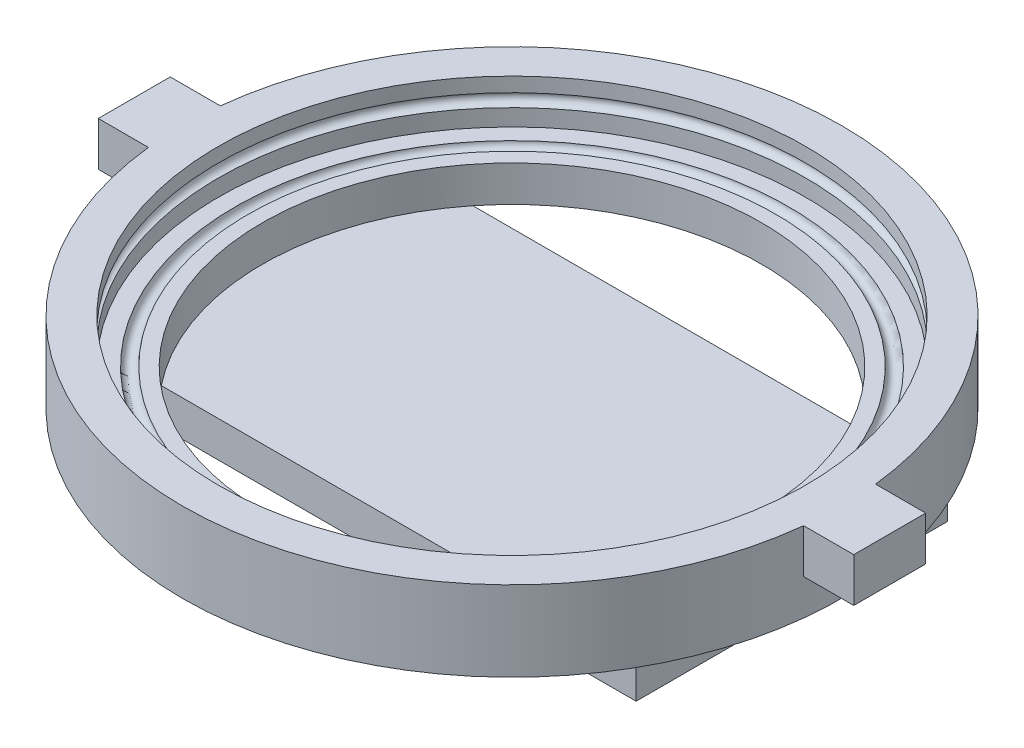
ISO-10303-21;
HEADER;
FILE_DESCRIPTION(('STEP AP214'),'2;1');
FILE_NAME('part.step','',(''),(''),'','','');
FILE_SCHEMA(('AUTOMOTIVE_DESIGN { 1 0 10303 214 1 1 1 1 }'));
ENDSEC;
DATA;
#1=APPLICATION_CONTEXT('core data for automotive mechanical design processes');
#2=APPLICATION_PROTOCOL_DEFINITION('international standard','automotive_design',2000,#1);
#3=PRODUCT_CONTEXT('',#1,'mechanical');
#4=PRODUCT('Part','Part','',(#3));
#5=PRODUCT_RELATED_PRODUCT_CATEGORY('part','',(#4));
#6=PRODUCT_DEFINITION_FORMATION('','',#4);
#7=PRODUCT_DEFINITION_CONTEXT('part definition',#1,'design');
#8=PRODUCT_DEFINITION('design','',#6,#7);
#9=PRODUCT_DEFINITION_SHAPE('','',#8);
#10=(LENGTH_UNIT() NAMED_UNIT(*) SI_UNIT(.MILLI.,.METRE.));
#11=(NAMED_UNIT(*) PLANE_ANGLE_UNIT() SI_UNIT($,.RADIAN.));
#12=(NAMED_UNIT(*) SI_UNIT($,.STERADIAN.) SOLID_ANGLE_UNIT());
#13=UNCERTAINTY_MEASURE_WITH_UNIT(LENGTH_MEASURE(1.E-05),#10,'distance_accuracy_value','');
#14=(GEOMETRIC_REPRESENTATION_CONTEXT(3) GLOBAL_UNCERTAINTY_ASSIGNED_CONTEXT((#13)) GLOBAL_UNIT_ASSIGNED_CONTEXT((#10,
#11,#12)) REPRESENTATION_CONTEXT('',''));
#15=CARTESIAN_POINT('',(0.,0.,0.));
#16=DIRECTION('',(0.,0.,1.));
#17=DIRECTION('',(1.,0.,0.));
#18=AXIS2_PLACEMENT_3D('',#15,#16,#17);
#19=CARTESIAN_POINT('',(116.3447,-38.9255,0.));
#20=DIRECTION('',(0.,1.,0.));
#21=DIRECTION('',(0.,0.,1.));
#22=AXIS2_PLACEMENT_3D('',#19,#20,#21);
#23=PLANE('',#22);
#24=CARTESIAN_POINT('',(0.,-38.9255,0.));
#25=DIRECTION('',(0.,1.,0.));
#26=DIRECTION('',(0.,0.,1.));
#27=AXIS2_PLACEMENT_3D('',#24,#25,#26);
#28=CIRCLE('',#27,116.3447);
#29=CARTESIAN_POINT('',(0.,-38.9255,116.3447));
#30=VERTEX_POINT('',#29);
#31=EDGE_CURVE('E286',#30,#30,#28,.T.);
#32=ORIENTED_EDGE('',*,*,#31,.F.);
#33=EDGE_LOOP('',(#32));
#34=FACE_BOUND('',#33,.T.);
#35=DIRECTION('',(-1.,0.,0.));
#36=VECTOR('',#35,1.);
#37=CARTESIAN_POINT('',(-98.806,-38.9255,54.991));
#38=LINE('',#37,#36);
#39=CARTESIAN_POINT('',(-68.8138410702382,-38.9255,54.991));
#40=VERTEX_POINT('',#39);
#41=CARTESIAN_POINT('',(-98.806,-38.9255,54.991));
#42=VERTEX_POINT('',#41);
#43=EDGE_CURVE('E237',#40,#42,#38,.T.);
#44=ORIENTED_EDGE('',*,*,#43,.F.);
#45=CARTESIAN_POINT('',(0.,-38.9255,0.));
#46=DIRECTION('',(0.,1.,0.));
#47=DIRECTION('',(0.,0.,1.));
#48=AXIS2_PLACEMENT_3D('',#45,#46,#47);
#49=CIRCLE('',#48,88.0872);
#50=CARTESIAN_POINT('',(68.8138410702382,-38.9255,54.991));
#51=VERTEX_POINT('',#50);
#52=EDGE_CURVE('E281',#40,#51,#49,.T.);
#53=ORIENTED_EDGE('',*,*,#52,.T.);
#54=CARTESIAN_POINT('',(98.806,-38.9255,54.991));
#55=VERTEX_POINT('',#54);
#56=EDGE_CURVE('E210',#55,#51,#38,.T.);
#57=ORIENTED_EDGE('',*,*,#56,.F.);
#58=DIRECTION('',(0.,0.,1.));
#59=VECTOR('',#58,1.);
#60=CARTESIAN_POINT('',(98.806,-38.9255,54.991));
#61=LINE('',#60,#59);
#62=CARTESIAN_POINT('',(98.806,-38.9255,-54.991));
#63=VERTEX_POINT('',#62);
#64=EDGE_CURVE('E228',#63,#55,#61,.T.);
#65=ORIENTED_EDGE('',*,*,#64,.F.);
#66=DIRECTION('',(1.,0.,0.));
#67=VECTOR('',#66,1.);
#68=CARTESIAN_POINT('',(-98.806,-38.9255,-54.991));
#69=LINE('',#68,#67);
#70=CARTESIAN_POINT('',(68.8138410702382,-38.9255,-54.991));
#71=VERTEX_POINT('',#70);
#72=EDGE_CURVE('E229',#71,#63,#69,.T.);
#73=ORIENTED_EDGE('',*,*,#72,.F.);
#74=CARTESIAN_POINT('',(-68.8138410702382,-38.9255,-54.991));
#75=VERTEX_POINT('',#74);
#76=EDGE_CURVE('E287',#71,#75,#49,.T.);
#77=ORIENTED_EDGE('',*,*,#76,.T.);
#78=CARTESIAN_POINT('',(-98.806,-38.9255,-54.991));
#79=VERTEX_POINT('',#78);
#80=EDGE_CURVE('E224',#79,#75,#69,.T.);
#81=ORIENTED_EDGE('',*,*,#80,.F.);
#82=DIRECTION('',(0.,0.,-1.));
#83=VECTOR('',#82,1.);
#84=CARTESIAN_POINT('',(-98.806,-38.9255,54.991));
#85=LINE('',#84,#83);
#86=EDGE_CURVE('E191',#42,#79,#85,.T.);
#87=ORIENTED_EDGE('',*,*,#86,.F.);
#88=EDGE_LOOP('',(#44,#53,#57,#65,#73,#77,#81,#87));
#89=FACE_BOUND('',#88,.T.);
#90=ADVANCED_FACE('F39',(#34,#89),#23,.F.);
#91=CARTESIAN_POINT('',(103.6447,-10.668,0.));
#92=DIRECTION('',(0.,-1.,0.));
#93=DIRECTION('',(0.,0.,-1.));
#94=AXIS2_PLACEMENT_3D('',#91,#92,#93);
#95=PLANE('',#94);
#96=DIRECTION('',(1.,0.,0.));
#97=VECTOR('',#96,1.);
#98=CARTESIAN_POINT('',(-133.35,-10.668,12.7));
#99=LINE('',#98,#97);
#100=CARTESIAN_POINT('',(-133.35,-10.668,12.7));
#101=VERTEX_POINT('',#100);
#102=CARTESIAN_POINT('',(-115.649467003052,-10.668,12.7));
#103=VERTEX_POINT('',#102);
#104=EDGE_CURVE('E157',#101,#103,#99,.T.);
#105=ORIENTED_EDGE('',*,*,#104,.T.);
#106=CARTESIAN_POINT('',(0.,-10.668,0.));
#107=DIRECTION('',(0.,1.,0.));
#108=DIRECTION('',(0.,0.,1.));
#109=AXIS2_PLACEMENT_3D('',#106,#107,#108);
#110=CIRCLE('',#109,116.3447);
#111=CARTESIAN_POINT('',(115.649467003052,-10.668,12.7));
#112=VERTEX_POINT('',#111);
#113=EDGE_CURVE('E291',#103,#112,#110,.T.);
#114=ORIENTED_EDGE('',*,*,#113,.T.);
#115=DIRECTION('',(1.,0.,0.));
#116=VECTOR('',#115,1.);
#117=CARTESIAN_POINT('',(133.35,-10.668,12.7));
#118=LINE('',#117,#116);
#119=CARTESIAN_POINT('',(133.35,-10.668,12.7));
#120=VERTEX_POINT('',#119);
#121=EDGE_CURVE('E183',#112,#120,#118,.T.);
#122=ORIENTED_EDGE('',*,*,#121,.T.);
#123=DIRECTION('',(0.,0.,-1.));
#124=VECTOR('',#123,1.);
#125=CARTESIAN_POINT('',(133.35,-10.668,-12.7));
#126=LINE('',#125,#124);
#127=CARTESIAN_POINT('',(133.35,-10.668,-12.7));
#128=VERTEX_POINT('',#127);
#129=EDGE_CURVE('E178',#120,#128,#126,.T.);
#130=ORIENTED_EDGE('',*,*,#129,.T.);
#131=DIRECTION('',(-1.,0.,0.));
#132=VECTOR('',#131,1.);
#133=CARTESIAN_POINT('',(133.35,-10.668,-12.7));
#134=LINE('',#133,#132);
#135=CARTESIAN_POINT('',(115.649467003052,-10.668,-12.7));
#136=VERTEX_POINT('',#135);
#137=EDGE_CURVE('E177',#128,#136,#134,.T.);
#138=ORIENTED_EDGE('',*,*,#137,.T.);
#139=CARTESIAN_POINT('',(-115.649467003052,-10.668,-12.7));
#140=VERTEX_POINT('',#139);
#141=EDGE_CURVE('E292',#136,#140,#110,.T.);
#142=ORIENTED_EDGE('',*,*,#141,.T.);
#143=DIRECTION('',(-1.,0.,0.));
#144=VECTOR('',#143,1.);
#145=CARTESIAN_POINT('',(-133.35,-10.668,-12.7));
#146=LINE('',#145,#144);
#147=CARTESIAN_POINT('',(-133.35,-10.668,-12.7));
#148=VERTEX_POINT('',#147);
#149=EDGE_CURVE('E55',#140,#148,#146,.T.);
#150=ORIENTED_EDGE('',*,*,#149,.T.);
#151=DIRECTION('',(0.,0.,1.));
#152=VECTOR('',#151,1.);
#153=CARTESIAN_POINT('',(-133.35,-10.668,-12.7));
#154=LINE('',#153,#152);
#155=EDGE_CURVE('E168',#148,#101,#154,.T.);
#156=ORIENTED_EDGE('',*,*,#155,.T.);
#157=EDGE_LOOP('',(#105,#114,#122,#130,#138,#142,#150,#156));
#158=FACE_BOUND('',#157,.T.);
#159=CARTESIAN_POINT('',(0.,-10.668,0.));
#160=DIRECTION('',(0.,1.,0.));
#161=DIRECTION('',(0.,0.,1.));
#162=AXIS2_PLACEMENT_3D('',#159,#160,#161);
#163=CIRCLE('',#162,103.6447);
#164=CARTESIAN_POINT('',(0.,-10.668,103.6447));
#165=VERTEX_POINT('',#164);
#166=EDGE_CURVE('E253',#165,#165,#163,.T.);
#167=ORIENTED_EDGE('',*,*,#166,.F.);
#168=EDGE_LOOP('',(#167));
#169=FACE_BOUND('',#168,.T.);
#170=ADVANCED_FACE('F41',(#158,#169),#95,.F.);
#171=CARTESIAN_POINT('',(0.,0.,0.));
#172=DIRECTION('',(0.,1.,0.));
#173=DIRECTION('',(0.,0.,1.));
#174=AXIS2_PLACEMENT_3D('',#171,#172,#173);
#175=CYLINDRICAL_SURFACE('',#174,116.3447);
#176=ORIENTED_EDGE('',*,*,#113,.F.);
#177=DIRECTION('',(0.,1.,0.));
#178=VECTOR('',#177,1.);
#179=CARTESIAN_POINT('',(-115.649467003052,0.,12.7));
#180=LINE('',#179,#178);
#181=CARTESIAN_POINT('',(-115.649467003052,-26.2255,12.7));
#182=VERTEX_POINT('',#181);
#183=EDGE_CURVE('E11',#103,#182,#180,.F.);
#184=ORIENTED_EDGE('',*,*,#183,.T.);
#185=CARTESIAN_POINT('',(0.,-26.2255,0.));
#186=DIRECTION('',(0.,-1.,0.));
#187=DIRECTION('',(0.,0.,-1.));
#188=AXIS2_PLACEMENT_3D('',#185,#186,#187);
#189=CIRCLE('',#188,116.3447);
#190=CARTESIAN_POINT('',(-115.649467003052,-26.2255,-12.7));
#191=VERTEX_POINT('',#190);
#192=EDGE_CURVE('E48',#182,#191,#189,.T.);
#193=ORIENTED_EDGE('',*,*,#192,.T.);
#194=DIRECTION('',(0.,1.,0.));
#195=VECTOR('',#194,1.);
#196=CARTESIAN_POINT('',(-115.649467003052,0.,-12.7));
#197=LINE('',#196,#195);
#198=EDGE_CURVE('E308',#191,#140,#197,.T.);
#199=ORIENTED_EDGE('',*,*,#198,.T.);
#200=ORIENTED_EDGE('',*,*,#141,.F.);
#201=DIRECTION('',(0.,1.,0.));
#202=VECTOR('',#201,1.);
#203=CARTESIAN_POINT('',(115.649467003052,0.,-12.7));
#204=LINE('',#203,#202);
#205=CARTESIAN_POINT('',(115.649467003052,-26.2255,-12.7));
#206=VERTEX_POINT('',#205);
#207=EDGE_CURVE('E296',#136,#206,#204,.F.);
#208=ORIENTED_EDGE('',*,*,#207,.T.);
#209=CARTESIAN_POINT('',(0.,-26.2255,0.));
#210=DIRECTION('',(0.,-1.,0.));
#211=DIRECTION('',(0.,0.,-1.));
#212=AXIS2_PLACEMENT_3D('',#209,#210,#211);
#213=CIRCLE('',#212,116.3447);
#214=CARTESIAN_POINT('',(115.649467003052,-26.2255,12.7));
#215=VERTEX_POINT('',#214);
#216=EDGE_CURVE('E300',#206,#215,#213,.T.);
#217=ORIENTED_EDGE('',*,*,#216,.T.);
#218=DIRECTION('',(0.,1.,0.));
#219=VECTOR('',#218,1.);
#220=CARTESIAN_POINT('',(115.649467003052,0.,12.7));
#221=LINE('',#220,#219);
#222=EDGE_CURVE('E304',#215,#112,#221,.T.);
#223=ORIENTED_EDGE('',*,*,#222,.T.);
#224=EDGE_LOOP('',(#176,#184,#193,#199,#200,#208,#217,#223));
#225=FACE_BOUND('',#224,.T.);
#226=ORIENTED_EDGE('',*,*,#31,.T.);
#227=EDGE_LOOP('',(#226));
#228=FACE_BOUND('',#227,.T.);
#229=ADVANCED_FACE('F313',(#225,#228),#175,.T.);
#230=CARTESIAN_POINT('',(0.,0.,0.));
#231=DIRECTION('',(0.,1.,0.));
#232=DIRECTION('',(0.,0.,1.));
#233=AXIS2_PLACEMENT_3D('',#230,#231,#232);
#234=CYLINDRICAL_SURFACE('',#233,88.0872);
#235=EDGE_CURVE('E282',#51,#71,#49,.T.);
#236=ORIENTED_EDGE('',*,*,#235,.F.);
#237=ORIENTED_EDGE('',*,*,#52,.F.);
#238=EDGE_CURVE('E595',#75,#40,#49,.T.);
#239=ORIENTED_EDGE('',*,*,#238,.F.);
#240=ORIENTED_EDGE('',*,*,#76,.F.);
#241=EDGE_LOOP('',(#236,#237,#239,#240));
#242=FACE_BOUND('',#241,.T.);
#243=CARTESIAN_POINT('',(0.,-26.2255,0.));
#244=DIRECTION('',(0.,1.,0.));
#245=DIRECTION('',(0.,0.,1.));
#246=AXIS2_PLACEMENT_3D('',#243,#244,#245);
#247=CIRCLE('',#246,88.0872);
#248=CARTESIAN_POINT('',(0.,-26.2255,88.0872));
#249=VERTEX_POINT('',#248);
#250=EDGE_CURVE('E277',#249,#249,#247,.T.);
#251=ORIENTED_EDGE('',*,*,#250,.T.);
#252=EDGE_LOOP('',(#251));
#253=FACE_BOUND('',#252,.T.);
#254=ADVANCED_FACE('F340',(#242,#253),#234,.F.);
#255=CARTESIAN_POINT('',(93.1672,-26.2255,0.));
#256=DIRECTION('',(0.,-1.,0.));
#257=DIRECTION('',(0.,0.,-1.));
#258=AXIS2_PLACEMENT_3D('',#255,#256,#257);
#259=PLANE('',#258);
#260=ORIENTED_EDGE('',*,*,#250,.F.);
#261=EDGE_LOOP('',(#260));
#262=FACE_BOUND('',#261,.T.);
#263=CARTESIAN_POINT('',(0.,-26.2255,0.));
#264=DIRECTION('',(0.,1.,0.));
#265=DIRECTION('',(0.,0.,1.));
#266=AXIS2_PLACEMENT_3D('',#263,#264,#265);
#267=CIRCLE('',#266,93.1672);
#268=CARTESIAN_POINT('',(0.,-26.2255,93.1672));
#269=VERTEX_POINT('',#268);
#270=EDGE_CURVE('E273',#269,#269,#267,.T.);
#271=ORIENTED_EDGE('',*,*,#270,.T.);
#272=EDGE_LOOP('',(#271));
#273=FACE_BOUND('',#272,.T.);
#274=ADVANCED_FACE('F346',(#262,#273),#259,.F.);
#275=CARTESIAN_POINT('',(0.,-26.2255,0.));
#276=DIRECTION('',(0.,1.,0.));
#277=DIRECTION('',(0.,0.,1.));
#278=AXIS2_PLACEMENT_3D('',#275,#276,#277);
#279=TOROIDAL_SURFACE('',#278,95.4532,2.28600000000001);
#280=ORIENTED_EDGE('',*,*,#270,.F.);
#281=EDGE_LOOP('',(#280));
#282=FACE_BOUND('',#281,.T.);
#283=CARTESIAN_POINT('',(0.,-26.2255,0.));
#284=DIRECTION('',(0.,1.,0.));
#285=DIRECTION('',(0.,0.,1.));
#286=AXIS2_PLACEMENT_3D('',#283,#284,#285);
#287=CIRCLE('',#286,97.7392);
#288=CARTESIAN_POINT('',(0.,-26.2255,97.7392));
#289=VERTEX_POINT('',#288);
#290=EDGE_CURVE('E269',#289,#289,#287,.T.);
#291=ORIENTED_EDGE('',*,*,#290,.T.);
#292=EDGE_LOOP('',(#291));
#293=FACE_BOUND('',#292,.T.);
#294=ADVANCED_FACE('F351',(#282,#293),#279,.F.);
#295=CARTESIAN_POINT('',(103.6447,-26.2255,0.));
#296=DIRECTION('',(0.,-1.,0.));
#297=DIRECTION('',(0.,0.,-1.));
#298=AXIS2_PLACEMENT_3D('',#295,#296,#297);
#299=PLANE('',#298);
#300=ORIENTED_EDGE('',*,*,#290,.F.);
#301=EDGE_LOOP('',(#300));
#302=FACE_BOUND('',#301,.T.);
#303=CARTESIAN_POINT('',(0.,-26.2255,0.));
#304=DIRECTION('',(0.,1.,0.));
#305=DIRECTION('',(0.,0.,1.));
#306=AXIS2_PLACEMENT_3D('',#303,#304,#305);
#307=CIRCLE('',#306,103.6447);
#308=CARTESIAN_POINT('',(0.,-26.2255,103.6447));
#309=VERTEX_POINT('',#308);
#310=EDGE_CURVE('E265',#309,#309,#307,.T.);
#311=ORIENTED_EDGE('',*,*,#310,.T.);
#312=EDGE_LOOP('',(#311));
#313=FACE_BOUND('',#312,.T.);
#314=ADVANCED_FACE('F364',(#302,#313),#299,.F.);
#315=CARTESIAN_POINT('',(0.,0.,0.));
#316=DIRECTION('',(0.,1.,0.));
#317=DIRECTION('',(0.,0.,1.));
#318=AXIS2_PLACEMENT_3D('',#315,#316,#317);
#319=CYLINDRICAL_SURFACE('',#318,103.6447);
#320=ORIENTED_EDGE('',*,*,#310,.F.);
#321=EDGE_LOOP('',(#320));
#322=FACE_BOUND('',#321,.T.);
#323=CARTESIAN_POINT('',(0.,-20.32,0.));
#324=DIRECTION('',(0.,1.,0.));
#325=DIRECTION('',(0.,0.,1.));
#326=AXIS2_PLACEMENT_3D('',#323,#324,#325);
#327=CIRCLE('',#326,103.6447);
#328=CARTESIAN_POINT('',(0.,-20.32,103.6447));
#329=VERTEX_POINT('',#328);
#330=EDGE_CURVE('E261',#329,#329,#327,.T.);
#331=ORIENTED_EDGE('',*,*,#330,.T.);
#332=EDGE_LOOP('',(#331));
#333=FACE_BOUND('',#332,.T.);
#334=ADVANCED_FACE('F370',(#322,#333),#319,.F.);
#335=CARTESIAN_POINT('',(0.,-18.034,0.));
#336=DIRECTION('',(0.,1.,0.));
#337=DIRECTION('',(0.,0.,1.));
#338=AXIS2_PLACEMENT_3D('',#335,#336,#337);
#339=TOROIDAL_SURFACE('',#338,103.6447,2.286);
#340=ORIENTED_EDGE('',*,*,#330,.F.);
#341=EDGE_LOOP('',(#340));
#342=FACE_BOUND('',#341,.T.);
#343=CARTESIAN_POINT('',(0.,-15.748,0.));
#344=DIRECTION('',(0.,1.,0.));
#345=DIRECTION('',(0.,0.,1.));
#346=AXIS2_PLACEMENT_3D('',#343,#344,#345);
#347=CIRCLE('',#346,103.6447);
#348=CARTESIAN_POINT('',(0.,-15.748,103.6447));
#349=VERTEX_POINT('',#348);
#350=EDGE_CURVE('E257',#349,#349,#347,.T.);
#351=ORIENTED_EDGE('',*,*,#350,.T.);
#352=EDGE_LOOP('',(#351));
#353=FACE_BOUND('',#352,.T.);
#354=ADVANCED_FACE('F376',(#342,#353),#339,.F.);
#355=CARTESIAN_POINT('',(0.,0.,0.));
#356=DIRECTION('',(0.,1.,0.));
#357=DIRECTION('',(0.,0.,1.));
#358=AXIS2_PLACEMENT_3D('',#355,#356,#357);
#359=CYLINDRICAL_SURFACE('',#358,103.6447);
#360=ORIENTED_EDGE('',*,*,#350,.F.);
#361=EDGE_LOOP('',(#360));
#362=FACE_BOUND('',#361,.T.);
#363=ORIENTED_EDGE('',*,*,#166,.T.);
#364=EDGE_LOOP('',(#363));
#365=FACE_BOUND('',#364,.T.);
#366=ADVANCED_FACE('F382',(#362,#365),#359,.F.);
#367=CARTESIAN_POINT('',(0.,-38.9255,0.));
#368=DIRECTION('',(0.,-1.,0.));
#369=DIRECTION('',(0.,0.,-1.));
#370=AXIS2_PLACEMENT_3D('',#367,#368,#369);
#371=PLANE('',#370);
#372=EDGE_CURVE('E233',#51,#40,#38,.T.);
#373=ORIENTED_EDGE('',*,*,#372,.F.);
#374=ORIENTED_EDGE('',*,*,#235,.T.);
#375=EDGE_CURVE('E223',#75,#71,#69,.T.);
#376=ORIENTED_EDGE('',*,*,#375,.F.);
#377=ORIENTED_EDGE('',*,*,#238,.T.);
#378=EDGE_LOOP('',(#373,#374,#376,#377));
#379=FACE_BOUND('',#378,.T.);
#380=ADVANCED_FACE('F388',(#379),#371,.F.);
#381=CARTESIAN_POINT('',(-98.806,-51.6255,54.991));
#382=DIRECTION('',(1.,0.,0.));
#383=DIRECTION('',(0.,0.,-1.));
#384=AXIS2_PLACEMENT_3D('',#381,#382,#383);
#385=PLANE('',#384);
#386=ORIENTED_EDGE('',*,*,#86,.T.);
#387=DIRECTION('',(0.,1.,0.));
#388=VECTOR('',#387,1.);
#389=CARTESIAN_POINT('',(-98.806,-51.6255,-54.991));
#390=LINE('',#389,#388);
#391=CARTESIAN_POINT('',(-98.806,-51.6255,-54.991));
#392=VERTEX_POINT('',#391);
#393=EDGE_CURVE('E249',#392,#79,#390,.T.);
#394=ORIENTED_EDGE('',*,*,#393,.F.);
#395=DIRECTION('',(0.,0.,-1.));
#396=VECTOR('',#395,1.);
#397=CARTESIAN_POINT('',(-98.806,-51.6255,54.991));
#398=LINE('',#397,#396);
#399=CARTESIAN_POINT('',(-98.806,-51.6255,54.991));
#400=VERTEX_POINT('',#399);
#401=EDGE_CURVE('E205',#400,#392,#398,.T.);
#402=ORIENTED_EDGE('',*,*,#401,.F.);
#403=DIRECTION('',(0.,1.,0.));
#404=VECTOR('',#403,1.);
#405=CARTESIAN_POINT('',(-98.806,-51.6255,54.991));
#406=LINE('',#405,#404);
#407=EDGE_CURVE('E219',#400,#42,#406,.T.);
#408=ORIENTED_EDGE('',*,*,#407,.T.);
#409=EDGE_LOOP('',(#386,#394,#402,#408));
#410=FACE_BOUND('',#409,.T.);
#411=ADVANCED_FACE('F394',(#410),#385,.F.);
#412=CARTESIAN_POINT('',(-98.806,-51.6255,-54.991));
#413=DIRECTION('',(0.,0.,1.));
#414=DIRECTION('',(1.,0.,0.));
#415=AXIS2_PLACEMENT_3D('',#412,#413,#414);
#416=PLANE('',#415);
#417=ORIENTED_EDGE('',*,*,#80,.T.);
#418=ORIENTED_EDGE('',*,*,#375,.T.);
#419=ORIENTED_EDGE('',*,*,#72,.T.);
#420=DIRECTION('',(0.,1.,0.));
#421=VECTOR('',#420,1.);
#422=CARTESIAN_POINT('',(98.806,-51.6255,-54.991));
#423=LINE('',#422,#421);
#424=CARTESIAN_POINT('',(98.806,-51.6255,-54.991));
#425=VERTEX_POINT('',#424);
#426=EDGE_CURVE('E245',#425,#63,#423,.T.);
#427=ORIENTED_EDGE('',*,*,#426,.F.);
#428=DIRECTION('',(1.,0.,0.));
#429=VECTOR('',#428,1.);
#430=CARTESIAN_POINT('',(-98.806,-51.6255,-54.991));
#431=LINE('',#430,#429);
#432=EDGE_CURVE('E209',#392,#425,#431,.T.);
#433=ORIENTED_EDGE('',*,*,#432,.F.);
#434=ORIENTED_EDGE('',*,*,#393,.T.);
#435=EDGE_LOOP('',(#417,#418,#419,#427,#433,#434));
#436=FACE_BOUND('',#435,.T.);
#437=ADVANCED_FACE('F400',(#436),#416,.F.);
#438=CARTESIAN_POINT('',(98.806,-51.6255,54.991));
#439=DIRECTION('',(-1.,0.,0.));
#440=DIRECTION('',(0.,0.,1.));
#441=AXIS2_PLACEMENT_3D('',#438,#439,#440);
#442=PLANE('',#441);
#443=ORIENTED_EDGE('',*,*,#64,.T.);
#444=DIRECTION('',(0.,1.,0.));
#445=VECTOR('',#444,1.);
#446=CARTESIAN_POINT('',(98.806,-51.6255,54.991));
#447=LINE('',#446,#445);
#448=CARTESIAN_POINT('',(98.806,-51.6255,54.991));
#449=VERTEX_POINT('',#448);
#450=EDGE_CURVE('E241',#449,#55,#447,.T.);
#451=ORIENTED_EDGE('',*,*,#450,.F.);
#452=DIRECTION('',(0.,0.,1.));
#453=VECTOR('',#452,1.);
#454=CARTESIAN_POINT('',(98.806,-51.6255,54.991));
#455=LINE('',#454,#453);
#456=EDGE_CURVE('E213',#425,#449,#455,.T.);
#457=ORIENTED_EDGE('',*,*,#456,.F.);
#458=ORIENTED_EDGE('',*,*,#426,.T.);
#459=EDGE_LOOP('',(#443,#451,#457,#458));
#460=FACE_BOUND('',#459,.T.);
#461=ADVANCED_FACE('F404',(#460),#442,.F.);
#462=CARTESIAN_POINT('',(-98.806,-51.6255,54.991));
#463=DIRECTION('',(0.,0.,-1.));
#464=DIRECTION('',(-1.,0.,0.));
#465=AXIS2_PLACEMENT_3D('',#462,#463,#464);
#466=PLANE('',#465);
#467=ORIENTED_EDGE('',*,*,#56,.T.);
#468=ORIENTED_EDGE('',*,*,#372,.T.);
#469=ORIENTED_EDGE('',*,*,#43,.T.);
#470=ORIENTED_EDGE('',*,*,#407,.F.);
#471=DIRECTION('',(-1.,0.,0.));
#472=VECTOR('',#471,1.);
#473=CARTESIAN_POINT('',(-98.806,-51.6255,54.991));
#474=LINE('',#473,#472);
#475=EDGE_CURVE('E216',#449,#400,#474,.T.);
#476=ORIENTED_EDGE('',*,*,#475,.F.);
#477=ORIENTED_EDGE('',*,*,#450,.T.);
#478=EDGE_LOOP('',(#467,#468,#469,#470,#476,#477));
#479=FACE_BOUND('',#478,.T.);
#480=ADVANCED_FACE('F408',(#479),#466,.F.);
#481=CARTESIAN_POINT('',(0.,-51.6255,0.));
#482=DIRECTION('',(0.,-1.,0.));
#483=DIRECTION('',(0.,0.,-1.));
#484=AXIS2_PLACEMENT_3D('',#481,#482,#483);
#485=PLANE('',#484);
#486=ORIENTED_EDGE('',*,*,#401,.T.);
#487=ORIENTED_EDGE('',*,*,#432,.T.);
#488=ORIENTED_EDGE('',*,*,#456,.T.);
#489=ORIENTED_EDGE('',*,*,#475,.T.);
#490=EDGE_LOOP('',(#486,#487,#488,#489));
#491=FACE_BOUND('',#490,.T.);
#492=ADVANCED_FACE('F411',(#491),#485,.T.);
#493=CARTESIAN_POINT('',(133.35,-57.9755,12.7));
#494=DIRECTION('',(0.,0.,1.));
#495=DIRECTION('',(1.,0.,0.));
#496=AXIS2_PLACEMENT_3D('',#493,#494,#495);
#497=PLANE('',#496);
#498=ORIENTED_EDGE('',*,*,#222,.F.);
#499=DIRECTION('',(1.,0.,0.));
#500=VECTOR('',#499,1.);
#501=CARTESIAN_POINT('',(133.35,-26.2255,12.7));
#502=LINE('',#501,#500);
#503=CARTESIAN_POINT('',(133.35,-26.2255,12.7));
#504=VERTEX_POINT('',#503);
#505=EDGE_CURVE('E182',#215,#504,#502,.T.);
#506=ORIENTED_EDGE('',*,*,#505,.T.);
#507=DIRECTION('',(0.,1.,0.));
#508=VECTOR('',#507,1.);
#509=CARTESIAN_POINT('',(133.35,-57.9755,12.7));
#510=LINE('',#509,#508);
#511=EDGE_CURVE('E197',#504,#120,#510,.T.);
#512=ORIENTED_EDGE('',*,*,#511,.T.);
#513=ORIENTED_EDGE('',*,*,#121,.F.);
#514=EDGE_LOOP('',(#498,#506,#512,#513));
#515=FACE_BOUND('',#514,.T.);
#516=ADVANCED_FACE('F416',(#515),#497,.T.);
#517=CARTESIAN_POINT('',(133.35,-57.9755,-12.7));
#518=DIRECTION('',(0.,0.,-1.));
#519=DIRECTION('',(-1.,0.,0.));
#520=AXIS2_PLACEMENT_3D('',#517,#518,#519);
#521=PLANE('',#520);
#522=ORIENTED_EDGE('',*,*,#207,.F.);
#523=ORIENTED_EDGE('',*,*,#137,.F.);
#524=DIRECTION('',(0.,1.,0.));
#525=VECTOR('',#524,1.);
#526=CARTESIAN_POINT('',(133.35,-57.9755,-12.7));
#527=LINE('',#526,#525);
#528=CARTESIAN_POINT('',(133.35,-26.2255,-12.7));
#529=VERTEX_POINT('',#528);
#530=EDGE_CURVE('E192',#529,#128,#527,.T.);
#531=ORIENTED_EDGE('',*,*,#530,.F.);
#532=DIRECTION('',(-1.,0.,0.));
#533=VECTOR('',#532,1.);
#534=CARTESIAN_POINT('',(133.35,-26.2255,-12.7));
#535=LINE('',#534,#533);
#536=EDGE_CURVE('E63',#529,#206,#535,.T.);
#537=ORIENTED_EDGE('',*,*,#536,.T.);
#538=EDGE_LOOP('',(#522,#523,#531,#537));
#539=FACE_BOUND('',#538,.T.);
#540=ADVANCED_FACE('F421',(#539),#521,.T.);
#541=CARTESIAN_POINT('',(103.6447,-26.2255,0.));
#542=DIRECTION('',(0.,-1.,0.));
#543=DIRECTION('',(0.,0.,-1.));
#544=AXIS2_PLACEMENT_3D('',#541,#542,#543);
#545=PLANE('',#544);
#546=ORIENTED_EDGE('',*,*,#216,.F.);
#547=ORIENTED_EDGE('',*,*,#536,.F.);
#548=DIRECTION('',(0.,0.,-1.));
#549=VECTOR('',#548,1.);
#550=CARTESIAN_POINT('',(133.35,-26.2255,-12.7));
#551=LINE('',#550,#549);
#552=EDGE_CURVE('E193',#504,#529,#551,.T.);
#553=ORIENTED_EDGE('',*,*,#552,.F.);
#554=ORIENTED_EDGE('',*,*,#505,.F.);
#555=EDGE_LOOP('',(#546,#547,#553,#554));
#556=FACE_BOUND('',#555,.T.);
#557=ADVANCED_FACE('F418',(#556),#545,.T.);
#558=CARTESIAN_POINT('',(133.35,-57.9755,-12.7));
#559=DIRECTION('',(1.,0.,0.));
#560=DIRECTION('',(0.,0.,-1.));
#561=AXIS2_PLACEMENT_3D('',#558,#559,#560);
#562=PLANE('',#561);
#563=ORIENTED_EDGE('',*,*,#511,.F.);
#564=ORIENTED_EDGE('',*,*,#552,.T.);
#565=ORIENTED_EDGE('',*,*,#530,.T.);
#566=ORIENTED_EDGE('',*,*,#129,.F.);
#567=EDGE_LOOP('',(#563,#564,#565,#566));
#568=FACE_BOUND('',#567,.T.);
#569=ADVANCED_FACE('F329',(#568),#562,.T.);
#570=CARTESIAN_POINT('',(-133.35,-57.9755,12.7));
#571=DIRECTION('',(0.,0.,1.));
#572=DIRECTION('',(1.,0.,0.));
#573=AXIS2_PLACEMENT_3D('',#570,#571,#572);
#574=PLANE('',#573);
#575=ORIENTED_EDGE('',*,*,#183,.F.);
#576=ORIENTED_EDGE('',*,*,#104,.F.);
#577=DIRECTION('',(0.,1.,0.));
#578=VECTOR('',#577,1.);
#579=CARTESIAN_POINT('',(-133.35,-57.9755,12.7));
#580=LINE('',#579,#578);
#581=CARTESIAN_POINT('',(-133.35,-26.2255,12.7));
#582=VERTEX_POINT('',#581);
#583=EDGE_CURVE('E152',#582,#101,#580,.T.);
#584=ORIENTED_EDGE('',*,*,#583,.F.);
#585=DIRECTION('',(1.,0.,0.));
#586=VECTOR('',#585,1.);
#587=CARTESIAN_POINT('',(-133.35,-26.2255,12.7));
#588=LINE('',#587,#586);
#589=EDGE_CURVE('E141',#582,#182,#588,.T.);
#590=ORIENTED_EDGE('',*,*,#589,.T.);
#591=EDGE_LOOP('',(#575,#576,#584,#590));
#592=FACE_BOUND('',#591,.T.);
#593=ADVANCED_FACE('F155',(#592),#574,.T.);
#594=CARTESIAN_POINT('',(-133.35,-57.9755,-12.7));
#595=DIRECTION('',(0.,0.,-1.));
#596=DIRECTION('',(-1.,0.,0.));
#597=AXIS2_PLACEMENT_3D('',#594,#595,#596);
#598=PLANE('',#597);
#599=ORIENTED_EDGE('',*,*,#198,.F.);
#600=DIRECTION('',(-1.,0.,0.));
#601=VECTOR('',#600,1.);
#602=CARTESIAN_POINT('',(-133.35,-26.2255,-12.7));
#603=LINE('',#602,#601);
#604=CARTESIAN_POINT('',(-133.35,-26.2255,-12.7));
#605=VERTEX_POINT('',#604);
#606=EDGE_CURVE('E151',#191,#605,#603,.T.);
#607=ORIENTED_EDGE('',*,*,#606,.T.);
#608=DIRECTION('',(0.,1.,0.));
#609=VECTOR('',#608,1.);
#610=CARTESIAN_POINT('',(-133.35,-57.9755,-12.7));
#611=LINE('',#610,#609);
#612=EDGE_CURVE('E164',#605,#148,#611,.T.);
#613=ORIENTED_EDGE('',*,*,#612,.T.);
#614=ORIENTED_EDGE('',*,*,#149,.F.);
#615=EDGE_LOOP('',(#599,#607,#613,#614));
#616=FACE_BOUND('',#615,.T.);
#617=ADVANCED_FACE('F321',(#616),#598,.T.);
#618=CARTESIAN_POINT('',(103.6447,-26.2255,0.));
#619=DIRECTION('',(0.,-1.,0.));
#620=DIRECTION('',(0.,0.,-1.));
#621=AXIS2_PLACEMENT_3D('',#618,#619,#620);
#622=PLANE('',#621);
#623=ORIENTED_EDGE('',*,*,#192,.F.);
#624=ORIENTED_EDGE('',*,*,#589,.F.);
#625=DIRECTION('',(0.,0.,1.));
#626=VECTOR('',#625,1.);
#627=CARTESIAN_POINT('',(-133.35,-26.2255,-12.7));
#628=LINE('',#627,#626);
#629=EDGE_CURVE('E146',#605,#582,#628,.T.);
#630=ORIENTED_EDGE('',*,*,#629,.F.);
#631=ORIENTED_EDGE('',*,*,#606,.F.);
#632=EDGE_LOOP('',(#623,#624,#630,#631));
#633=FACE_BOUND('',#632,.T.);
#634=ADVANCED_FACE('F143',(#633),#622,.T.);
#635=CARTESIAN_POINT('',(-133.35,-57.9755,-12.7));
#636=DIRECTION('',(-1.,0.,0.));
#637=DIRECTION('',(0.,0.,1.));
#638=AXIS2_PLACEMENT_3D('',#635,#636,#637);
#639=PLANE('',#638);
#640=ORIENTED_EDGE('',*,*,#612,.F.);
#641=ORIENTED_EDGE('',*,*,#629,.T.);
#642=ORIENTED_EDGE('',*,*,#583,.T.);
#643=ORIENTED_EDGE('',*,*,#155,.F.);
#644=EDGE_LOOP('',(#640,#641,#642,#643));
#645=FACE_BOUND('',#644,.T.);
#646=ADVANCED_FACE('F163',(#645),#639,.T.);
#647=CLOSED_SHELL('',(#90,#170,#229,#254,#274,#294,#314,#334,#354,#366,#380,#411,#437,#461,#480,
#492,#516,#540,#557,#569,#593,#617,#634,#646));
#648=MANIFOLD_SOLID_BREP('B2',#647);
#649=ADVANCED_BREP_SHAPE_REPRESENTATION('',(#18,#648),#14);
#650=SHAPE_DEFINITION_REPRESENTATION(#9,#649);
ENDSEC;
END-ISO-10303-21;
